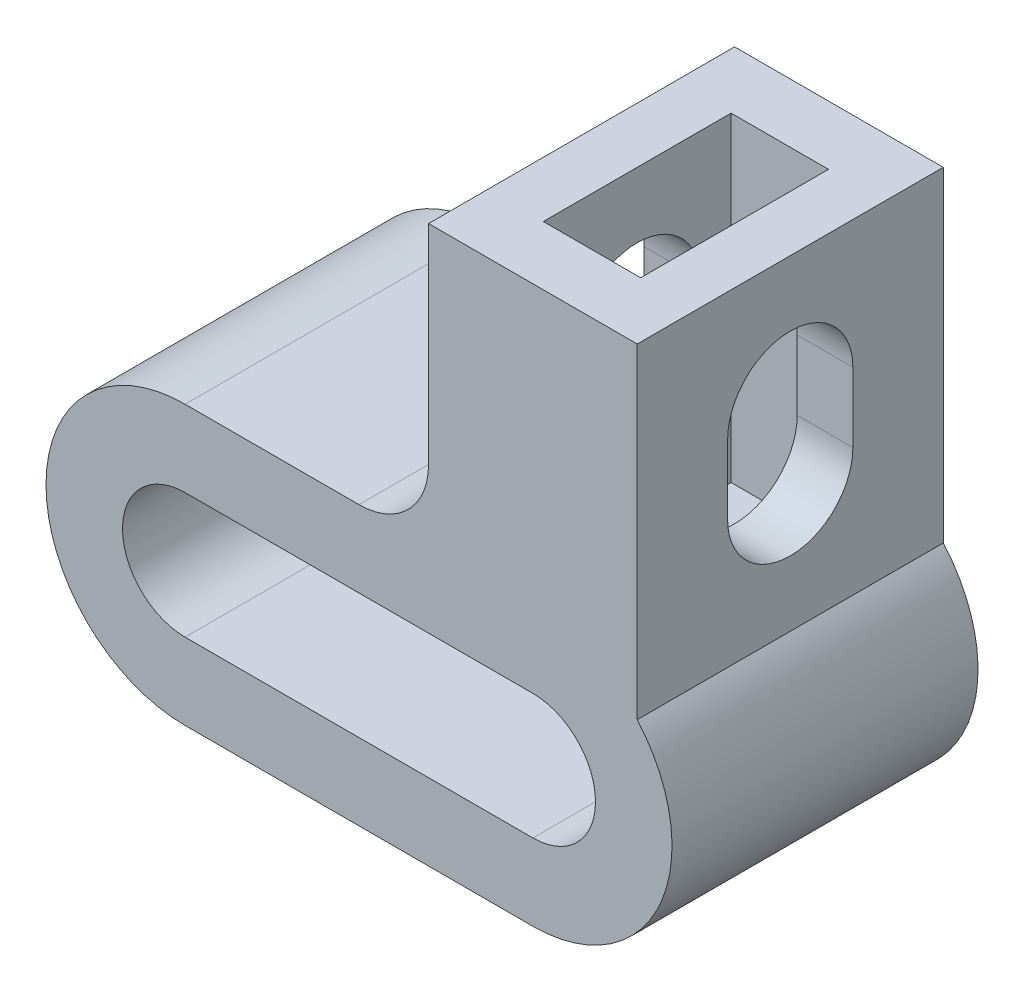
ISO-10303-21;
HEADER;
FILE_DESCRIPTION(('STEP AP214'),'2;1');
FILE_NAME('part.step','',(''),(''),'','','');
FILE_SCHEMA(('AUTOMOTIVE_DESIGN { 1 0 10303 214 1 1 1 1 }'));
ENDSEC;
DATA;
#1=APPLICATION_CONTEXT('core data for automotive mechanical design processes');
#2=APPLICATION_PROTOCOL_DEFINITION('international standard','automotive_design',2000,#1);
#3=PRODUCT_CONTEXT('',#1,'mechanical');
#4=PRODUCT('Part','Part','',(#3));
#5=PRODUCT_RELATED_PRODUCT_CATEGORY('part','',(#4));
#6=PRODUCT_DEFINITION_FORMATION('','',#4);
#7=PRODUCT_DEFINITION_CONTEXT('part definition',#1,'design');
#8=PRODUCT_DEFINITION('design','',#6,#7);
#9=PRODUCT_DEFINITION_SHAPE('','',#8);
#10=(LENGTH_UNIT() NAMED_UNIT(*) SI_UNIT(.MILLI.,.METRE.));
#11=(NAMED_UNIT(*) PLANE_ANGLE_UNIT() SI_UNIT($,.RADIAN.));
#12=(NAMED_UNIT(*) SI_UNIT($,.STERADIAN.) SOLID_ANGLE_UNIT());
#13=UNCERTAINTY_MEASURE_WITH_UNIT(LENGTH_MEASURE(1.E-05),#10,'distance_accuracy_value','');
#14=(GEOMETRIC_REPRESENTATION_CONTEXT(3) GLOBAL_UNCERTAINTY_ASSIGNED_CONTEXT((#13)) GLOBAL_UNIT_ASSIGNED_CONTEXT((#10,
#11,#12)) REPRESENTATION_CONTEXT('',''));
#15=CARTESIAN_POINT('',(0.,0.,0.));
#16=DIRECTION('',(0.,0.,1.));
#17=DIRECTION('',(1.,0.,0.));
#18=AXIS2_PLACEMENT_3D('',#15,#16,#17);
#19=CARTESIAN_POINT('',(7.5,0.,22.));
#20=DIRECTION('',(-1.,0.,0.));
#21=DIRECTION('',(0.,0.,1.));
#22=AXIS2_PLACEMENT_3D('',#19,#20,#21);
#23=PLANE('',#22);
#24=DIRECTION('',(0.,1.,0.));
#25=VECTOR('',#24,1.);
#26=CARTESIAN_POINT('',(7.5,0.,0.));
#27=LINE('',#26,#25);
#28=CARTESIAN_POINT('',(7.5,6.61437827766148,0.));
#29=VERTEX_POINT('',#28);
#30=CARTESIAN_POINT('',(7.5,30.,0.));
#31=VERTEX_POINT('',#30);
#32=EDGE_CURVE('E365',#29,#31,#27,.T.);
#33=ORIENTED_EDGE('',*,*,#32,.T.);
#34=DIRECTION('',(0.,0.,-1.));
#35=VECTOR('',#34,1.);
#36=CARTESIAN_POINT('',(7.5,30.,22.));
#37=LINE('',#36,#35);
#38=CARTESIAN_POINT('',(7.5,30.,22.));
#39=VERTEX_POINT('',#38);
#40=EDGE_CURVE('E395',#39,#31,#37,.T.);
#41=ORIENTED_EDGE('',*,*,#40,.F.);
#42=DIRECTION('',(0.,1.,0.));
#43=VECTOR('',#42,1.);
#44=CARTESIAN_POINT('',(7.5,0.,22.));
#45=LINE('',#44,#43);
#46=CARTESIAN_POINT('',(7.5,6.61437827766148,22.));
#47=VERTEX_POINT('',#46);
#48=EDGE_CURVE('E491',#47,#39,#45,.T.);
#49=ORIENTED_EDGE('',*,*,#48,.F.);
#50=DIRECTION('',(0.,0.,-1.));
#51=VECTOR('',#50,1.);
#52=CARTESIAN_POINT('',(7.5,6.61437827766148,22.));
#53=LINE('',#52,#51);
#54=EDGE_CURVE('E397',#47,#29,#53,.T.);
#55=ORIENTED_EDGE('',*,*,#54,.T.);
#56=EDGE_LOOP('',(#33,#41,#49,#55));
#57=FACE_BOUND('',#56,.T.);
#58=CARTESIAN_POINT('',(7.5,15.8071891388307,11.));
#59=DIRECTION('',(-1.,0.,0.));
#60=DIRECTION('',(0.,0.,1.));
#61=AXIS2_PLACEMENT_3D('',#58,#59,#60);
#62=CIRCLE('',#61,4.5);
#63=CARTESIAN_POINT('',(7.5,15.8071891388307,15.5));
#64=VERTEX_POINT('',#63);
#65=CARTESIAN_POINT('',(7.5,15.8071891388307,6.5));
#66=VERTEX_POINT('',#65);
#67=EDGE_CURVE('E441',#64,#66,#62,.F.);
#68=ORIENTED_EDGE('',*,*,#67,.F.);
#69=DIRECTION('',(0.,-1.,0.));
#70=VECTOR('',#69,1.);
#71=CARTESIAN_POINT('',(7.5,0.,15.5));
#72=LINE('',#71,#70);
#73=CARTESIAN_POINT('',(7.5,20.8071891388307,15.5));
#74=VERTEX_POINT('',#73);
#75=EDGE_CURVE('E226',#74,#64,#72,.T.);
#76=ORIENTED_EDGE('',*,*,#75,.F.);
#77=CARTESIAN_POINT('',(7.5,20.8071891388307,11.));
#78=DIRECTION('',(-1.,0.,0.));
#79=DIRECTION('',(0.,0.,1.));
#80=AXIS2_PLACEMENT_3D('',#77,#78,#79);
#81=CIRCLE('',#80,4.5);
#82=CARTESIAN_POINT('',(7.5,20.8071891388307,6.5));
#83=VERTEX_POINT('',#82);
#84=EDGE_CURVE('E217',#83,#74,#81,.F.);
#85=ORIENTED_EDGE('',*,*,#84,.F.);
#86=DIRECTION('',(0.,1.,0.));
#87=VECTOR('',#86,1.);
#88=CARTESIAN_POINT('',(7.5,0.,6.5));
#89=LINE('',#88,#87);
#90=EDGE_CURVE('E238',#66,#83,#89,.T.);
#91=ORIENTED_EDGE('',*,*,#90,.F.);
#92=EDGE_LOOP('',(#68,#76,#85,#91));
#93=FACE_BOUND('',#92,.T.);
#94=ADVANCED_FACE('F35',(#57,#93),#23,.F.);
#95=CARTESIAN_POINT('',(-7.5,0.,22.));
#96=DIRECTION('',(-1.,0.,0.));
#97=DIRECTION('',(0.,0.,1.));
#98=AXIS2_PLACEMENT_3D('',#95,#96,#97);
#99=PLANE('',#98);
#100=DIRECTION('',(0.,-1.,0.));
#101=VECTOR('',#100,1.);
#102=CARTESIAN_POINT('',(-7.5,0.,15.5));
#103=LINE('',#102,#101);
#104=CARTESIAN_POINT('',(-7.5,20.8071891388307,15.5));
#105=VERTEX_POINT('',#104);
#106=CARTESIAN_POINT('',(-7.5,15.8071891388307,15.5));
#107=VERTEX_POINT('',#106);
#108=EDGE_CURVE('E208',#105,#107,#103,.T.);
#109=ORIENTED_EDGE('',*,*,#108,.T.);
#110=CARTESIAN_POINT('',(-7.5,15.8071891388307,11.));
#111=DIRECTION('',(-1.,0.,0.));
#112=DIRECTION('',(0.,0.,1.));
#113=AXIS2_PLACEMENT_3D('',#110,#111,#112);
#114=CIRCLE('',#113,4.5);
#115=CARTESIAN_POINT('',(-7.5,15.,15.4270131798035));
#116=VERTEX_POINT('',#115);
#117=EDGE_CURVE('E436',#107,#116,#114,.F.);
#118=ORIENTED_EDGE('',*,*,#117,.T.);
#119=DIRECTION('',(0.,0.,-1.));
#120=VECTOR('',#119,1.);
#121=CARTESIAN_POINT('',(-7.5,15.,22.));
#122=LINE('',#121,#120);
#123=CARTESIAN_POINT('',(-7.5,15.,22.));
#124=VERTEX_POINT('',#123);
#125=EDGE_CURVE('E390',#124,#116,#122,.T.);
#126=ORIENTED_EDGE('',*,*,#125,.F.);
#127=DIRECTION('',(0.,1.,0.));
#128=VECTOR('',#127,1.);
#129=CARTESIAN_POINT('',(-7.5,0.,22.));
#130=LINE('',#129,#128);
#131=CARTESIAN_POINT('',(-7.5,30.,22.));
#132=VERTEX_POINT('',#131);
#133=EDGE_CURVE('E496',#124,#132,#130,.T.);
#134=ORIENTED_EDGE('',*,*,#133,.T.);
#135=DIRECTION('',(0.,0.,-1.));
#136=VECTOR('',#135,1.);
#137=CARTESIAN_POINT('',(-7.5,30.,22.));
#138=LINE('',#137,#136);
#139=CARTESIAN_POINT('',(-7.5,30.,0.));
#140=VERTEX_POINT('',#139);
#141=EDGE_CURVE('E393',#132,#140,#138,.T.);
#142=ORIENTED_EDGE('',*,*,#141,.T.);
#143=DIRECTION('',(0.,1.,0.));
#144=VECTOR('',#143,1.);
#145=CARTESIAN_POINT('',(-7.5,0.,0.));
#146=LINE('',#145,#144);
#147=CARTESIAN_POINT('',(-7.5,15.,0.));
#148=VERTEX_POINT('',#147);
#149=EDGE_CURVE('E370',#148,#140,#146,.T.);
#150=ORIENTED_EDGE('',*,*,#149,.F.);
#151=CARTESIAN_POINT('',(-7.5,15.,6.57298682019652));
#152=VERTEX_POINT('',#151);
#153=EDGE_CURVE('E389',#152,#148,#122,.T.);
#154=ORIENTED_EDGE('',*,*,#153,.F.);
#155=CARTESIAN_POINT('',(-7.5,15.8071891388307,6.5));
#156=VERTEX_POINT('',#155);
#157=EDGE_CURVE('E58',#152,#156,#114,.F.);
#158=ORIENTED_EDGE('',*,*,#157,.T.);
#159=DIRECTION('',(0.,1.,0.));
#160=VECTOR('',#159,1.);
#161=CARTESIAN_POINT('',(-7.5,0.,6.5));
#162=LINE('',#161,#160);
#163=CARTESIAN_POINT('',(-7.5,20.8071891388307,6.5));
#164=VERTEX_POINT('',#163);
#165=EDGE_CURVE('E235',#156,#164,#162,.T.);
#166=ORIENTED_EDGE('',*,*,#165,.T.);
#167=CARTESIAN_POINT('',(-7.5,20.8071891388307,11.));
#168=DIRECTION('',(-1.,0.,0.));
#169=DIRECTION('',(0.,0.,1.));
#170=AXIS2_PLACEMENT_3D('',#167,#168,#169);
#171=CIRCLE('',#170,4.5);
#172=EDGE_CURVE('E225',#164,#105,#171,.F.);
#173=ORIENTED_EDGE('',*,*,#172,.T.);
#174=EDGE_LOOP('',(#109,#118,#126,#134,#142,#150,#154,#158,#166,#173));
#175=FACE_BOUND('',#174,.T.);
#176=ADVANCED_FACE('F311',(#175),#99,.T.);
#177=CARTESIAN_POINT('',(-12.5,15.,22.));
#178=DIRECTION('',(0.,0.,-1.));
#179=DIRECTION('',(-1.,0.,0.));
#180=AXIS2_PLACEMENT_3D('',#177,#178,#179);
#181=CYLINDRICAL_SURFACE('',#180,5.);
#182=ORIENTED_EDGE('',*,*,#125,.T.);
#183=CARTESIAN_POINT('',(-7.5,15.,15.4270131798035));
#184=CARTESIAN_POINT('',(-7.49997471508249,14.8913077840519,15.4072214641731));
#185=CARTESIAN_POINT('',(-7.50354304966086,14.7833935964909,15.3833842019889));
#186=CARTESIAN_POINT('',(-7.51737646658634,14.5701136639406,15.3280142157194));
#187=CARTESIAN_POINT('',(-7.52763438140666,14.4647453163873,15.2964897506679));
#188=CARTESIAN_POINT('',(-7.55424639194066,14.2581832404196,15.2263923372156));
#189=CARTESIAN_POINT('',(-7.57054862473275,14.1569619063967,15.1878807372746));
#190=CARTESIAN_POINT('',(-7.60864424465544,13.9584300945017,15.1041090746346));
#191=CARTESIAN_POINT('',(-7.6304388967668,13.8611205235578,15.0588474582943));
#192=CARTESIAN_POINT('',(-7.70288566704483,13.5767010885505,14.9140739388203));
#193=CARTESIAN_POINT('',(-7.76074504039169,13.3960670650988,14.8052168879543));
#194=CARTESIAN_POINT('',(-7.89028242345123,13.0547480759243,14.5661884404784));
#195=CARTESIAN_POINT('',(-7.96199110713091,12.8941087185711,14.4359698297513));
#196=CARTESIAN_POINT('',(-8.12337189500613,12.5749204768652,14.1393910350993));
#197=CARTESIAN_POINT('',(-8.2141685252315,12.4192615809314,13.9705388555918));
#198=CARTESIAN_POINT('',(-8.39823990377053,12.1357124653929,13.6120064408322));
#199=CARTESIAN_POINT('',(-8.4915163064611,12.0078413340704,13.4223120222288));
#200=CARTESIAN_POINT('',(-8.66637754201002,11.7872062144436,13.0339437798514));
#201=CARTESIAN_POINT('',(-8.7483211222995,11.6929271088792,12.8362972549902));
#202=CARTESIAN_POINT('',(-8.89579841964129,11.5327815972576,12.424105123367));
#203=CARTESIAN_POINT('',(-8.96136648657203,11.4668555033832,12.2095961528466));
#204=CARTESIAN_POINT('',(-9.05186244410561,11.3787560513416,11.8180997615287));
#205=CARTESIAN_POINT('',(-9.08269913595322,11.3499683171109,11.6440107496782));
#206=CARTESIAN_POINT('',(-9.12244562517694,11.3131425539663,11.2913031829068));
#207=CARTESIAN_POINT('',(-9.13139169489751,11.3050701989797,11.1126926170762));
#208=CARTESIAN_POINT('',(-9.12570560831094,11.3102657465503,10.7560170761483));
#209=CARTESIAN_POINT('',(-9.11105201143748,11.3235530545848,10.5779527445963));
#210=CARTESIAN_POINT('',(-9.060875852984,11.3704609945878,10.2274333070717));
#211=CARTESIAN_POINT('',(-9.02531385452653,11.4041200547585,10.0549894527496));
#212=CARTESIAN_POINT('',(-8.92270633405167,11.5057440101789,9.65687990149469));
#213=CARTESIAN_POINT('',(-8.84888704222559,11.5817820119884,9.43503442411864));
#214=CARTESIAN_POINT('',(-8.7269344885363,11.7185747577488,9.11674536955891));
#215=CARTESIAN_POINT('',(-8.68434485680684,11.7680477201151,9.01292575413945));
#216=CARTESIAN_POINT('',(-8.59682083750125,11.8743114466265,8.81012424614602));
#217=CARTESIAN_POINT('',(-8.55188669837691,11.9311014363061,8.71114184310792));
#218=CARTESIAN_POINT('',(-8.41241903493007,12.116246444494,8.41495741543997));
#219=CARTESIAN_POINT('',(-8.31615009644209,12.2562742909458,8.22571892721576));
#220=CARTESIAN_POINT('',(-8.12897109631137,12.5654973897316,7.87000332471217));
#221=CARTESIAN_POINT('',(-8.03805713829006,12.7346710742647,7.703509541637));
#222=CARTESIAN_POINT('',(-7.87781425197085,13.0845459532866,7.41051977521911));
#223=CARTESIAN_POINT('',(-7.80727131597867,13.2627748832869,7.28175766680785));
#224=CARTESIAN_POINT('',(-7.68430207509904,13.6404809820267,7.04977921546457));
#225=CARTESIAN_POINT('',(-7.63182918219285,13.83990174843,6.94649737772414));
#226=CARTESIAN_POINT('',(-7.56219556154501,14.1989170860046,6.79400950838239));
#227=CARTESIAN_POINT('',(-7.53929364779376,14.3543977533261,6.73774273405555));
#228=CARTESIAN_POINT('',(-7.51595971400224,14.5928487512128,6.66614265460484));
#229=CARTESIAN_POINT('',(-7.51001732883676,14.6734002204145,6.64437321665019));
#230=CARTESIAN_POINT('',(-7.50203330652672,14.835817234281,6.60529547966579));
#231=CARTESIAN_POINT('',(-7.49999396600165,14.9176835240607,6.58798981237458));
#232=CARTESIAN_POINT('',(-7.5,15.,6.57298682019652));
#233=B_SPLINE_CURVE_WITH_KNOTS('',3,(#183,#184,#185,#186,#187,#188,#189,#190,#191,#192,#193,
#194,#195,#196,#197,#198,#199,#200,#201,#202,#203,#204,#205,#206,#207,#208,#209,#210,#211,#212,
#213,#214,#215,#216,#217,#218,#219,#220,#221,#222,#223,#224,#225,#226,#227,#228,#229,#230,#231,
#232),.UNSPECIFIED.,.F.,.F.,(4,2,2,2,2,2,2,2,2,2,2,2,2,2,2,2,2,2,2,2,2,2,2,2,4),(0.,
0.331243704142386,0.662133080224524,0.990246617094524,1.31843579226186,1.9715482661598,
2.62612421952053,3.36434176654526,4.10306482637942,4.8021666745491,5.49978950581455,
6.03491703787051,6.56915727153477,7.10388314240726,7.63962084953676,8.37289337309912,
8.74057053696276,9.10820881622056,9.86835609794051,10.6279432710851,11.3180079647477,
12.0062799812122,12.5054259437164,12.7561841511695,13.0070898638137),.UNSPECIFIED.);
#234=EDGE_CURVE('E242',#116,#152,#233,.T.);
#235=ORIENTED_EDGE('',*,*,#234,.T.);
#236=ORIENTED_EDGE('',*,*,#153,.T.);
#237=CARTESIAN_POINT('',(-12.5,15.,0.));
#238=DIRECTION('',(0.,0.,1.));
#239=DIRECTION('',(1.,0.,0.));
#240=AXIS2_PLACEMENT_3D('',#237,#238,#239);
#241=CIRCLE('',#240,5.);
#242=CARTESIAN_POINT('',(-12.5,9.99999999999999,0.));
#243=VERTEX_POINT('',#242);
#244=EDGE_CURVE('E373',#243,#148,#241,.T.);
#245=ORIENTED_EDGE('',*,*,#244,.F.);
#246=DIRECTION('',(0.,0.,-1.));
#247=VECTOR('',#246,1.);
#248=CARTESIAN_POINT('',(-12.5,9.99999999999999,22.));
#249=LINE('',#248,#247);
#250=CARTESIAN_POINT('',(-12.5,9.99999999999999,22.));
#251=VERTEX_POINT('',#250);
#252=EDGE_CURVE('E387',#251,#243,#249,.T.);
#253=ORIENTED_EDGE('',*,*,#252,.F.);
#254=CARTESIAN_POINT('',(-12.5,15.,22.));
#255=DIRECTION('',(0.,0.,1.));
#256=DIRECTION('',(1.,0.,0.));
#257=AXIS2_PLACEMENT_3D('',#254,#255,#256);
#258=CIRCLE('',#257,5.);
#259=EDGE_CURVE('E499',#251,#124,#258,.T.);
#260=ORIENTED_EDGE('',*,*,#259,.T.);
#261=EDGE_LOOP('',(#182,#235,#236,#245,#253,#260));
#262=FACE_BOUND('',#261,.T.);
#263=ADVANCED_FACE('F250',(#262),#181,.F.);
#264=CARTESIAN_POINT('',(3.5,7.,4.25));
#265=DIRECTION('',(1.,0.,0.));
#266=DIRECTION('',(0.,0.,-1.));
#267=AXIS2_PLACEMENT_3D('',#264,#265,#266);
#268=PLANE('',#267);
#269=DIRECTION('',(0.,0.,-1.));
#270=VECTOR('',#269,1.);
#271=CARTESIAN_POINT('',(3.5,30.,4.25));
#272=LINE('',#271,#270);
#273=CARTESIAN_POINT('',(3.5,30.,17.75));
#274=VERTEX_POINT('',#273);
#275=CARTESIAN_POINT('',(3.5,30.,4.25));
#276=VERTEX_POINT('',#275);
#277=EDGE_CURVE('E442',#274,#276,#272,.T.);
#278=ORIENTED_EDGE('',*,*,#277,.T.);
#279=DIRECTION('',(0.,1.,0.));
#280=VECTOR('',#279,1.);
#281=CARTESIAN_POINT('',(3.5,7.,4.25));
#282=LINE('',#281,#280);
#283=CARTESIAN_POINT('',(3.5,7.,4.25));
#284=VERTEX_POINT('',#283);
#285=EDGE_CURVE('E461',#284,#276,#282,.T.);
#286=ORIENTED_EDGE('',*,*,#285,.F.);
#287=DIRECTION('',(0.,0.,-1.));
#288=VECTOR('',#287,1.);
#289=CARTESIAN_POINT('',(3.5,7.,4.25));
#290=LINE('',#289,#288);
#291=CARTESIAN_POINT('',(3.5,7.,17.75));
#292=VERTEX_POINT('',#291);
#293=EDGE_CURVE('E449',#292,#284,#290,.T.);
#294=ORIENTED_EDGE('',*,*,#293,.F.);
#295=DIRECTION('',(0.,1.,0.));
#296=VECTOR('',#295,1.);
#297=CARTESIAN_POINT('',(3.5,7.,17.75));
#298=LINE('',#297,#296);
#299=EDGE_CURVE('E470',#292,#274,#298,.T.);
#300=ORIENTED_EDGE('',*,*,#299,.T.);
#301=EDGE_LOOP('',(#278,#286,#294,#300));
#302=FACE_BOUND('',#301,.T.);
#303=CARTESIAN_POINT('',(3.5,15.8071891388307,11.));
#304=DIRECTION('',(1.,0.,0.));
#305=DIRECTION('',(0.,0.,-1.));
#306=AXIS2_PLACEMENT_3D('',#303,#304,#305);
#307=CIRCLE('',#306,4.5);
#308=CARTESIAN_POINT('',(3.5,15.8071891388307,6.5));
#309=VERTEX_POINT('',#308);
#310=CARTESIAN_POINT('',(3.5,15.8071891388307,15.5));
#311=VERTEX_POINT('',#310);
#312=EDGE_CURVE('E240',#309,#311,#307,.F.);
#313=ORIENTED_EDGE('',*,*,#312,.F.);
#314=DIRECTION('',(0.,-1.,0.));
#315=VECTOR('',#314,1.);
#316=CARTESIAN_POINT('',(3.5,7.,6.5));
#317=LINE('',#316,#315);
#318=CARTESIAN_POINT('',(3.5,20.8071891388307,6.5));
#319=VERTEX_POINT('',#318);
#320=EDGE_CURVE('E224',#319,#309,#317,.T.);
#321=ORIENTED_EDGE('',*,*,#320,.F.);
#322=CARTESIAN_POINT('',(3.5,20.8071891388307,11.));
#323=DIRECTION('',(1.,0.,0.));
#324=DIRECTION('',(0.,0.,-1.));
#325=AXIS2_PLACEMENT_3D('',#322,#323,#324);
#326=CIRCLE('',#325,4.5);
#327=CARTESIAN_POINT('',(3.5,20.8071891388307,15.5));
#328=VERTEX_POINT('',#327);
#329=EDGE_CURVE('E214',#328,#319,#326,.F.);
#330=ORIENTED_EDGE('',*,*,#329,.F.);
#331=DIRECTION('',(0.,1.,0.));
#332=VECTOR('',#331,1.);
#333=CARTESIAN_POINT('',(3.5,7.,15.5));
#334=LINE('',#333,#332);
#335=EDGE_CURVE('E200',#311,#328,#334,.T.);
#336=ORIENTED_EDGE('',*,*,#335,.F.);
#337=EDGE_LOOP('',(#313,#321,#330,#336));
#338=FACE_BOUND('',#337,.T.);
#339=ADVANCED_FACE('F223',(#302,#338),#268,.F.);
#340=CARTESIAN_POINT('',(-3.5,7.,4.25));
#341=DIRECTION('',(-1.,0.,0.));
#342=DIRECTION('',(0.,0.,1.));
#343=AXIS2_PLACEMENT_3D('',#340,#341,#342);
#344=PLANE('',#343);
#345=DIRECTION('',(0.,0.,1.));
#346=VECTOR('',#345,1.);
#347=CARTESIAN_POINT('',(-3.5,30.,4.25));
#348=LINE('',#347,#346);
#349=CARTESIAN_POINT('',(-3.5,30.,4.25));
#350=VERTEX_POINT('',#349);
#351=CARTESIAN_POINT('',(-3.5,30.,17.75));
#352=VERTEX_POINT('',#351);
#353=EDGE_CURVE('E465',#350,#352,#348,.T.);
#354=ORIENTED_EDGE('',*,*,#353,.T.);
#355=DIRECTION('',(0.,1.,0.));
#356=VECTOR('',#355,1.);
#357=CARTESIAN_POINT('',(-3.5,7.,17.75));
#358=LINE('',#357,#356);
#359=CARTESIAN_POINT('',(-3.5,7.,17.75));
#360=VERTEX_POINT('',#359);
#361=EDGE_CURVE('E472',#360,#352,#358,.T.);
#362=ORIENTED_EDGE('',*,*,#361,.F.);
#363=DIRECTION('',(0.,0.,1.));
#364=VECTOR('',#363,1.);
#365=CARTESIAN_POINT('',(-3.5,7.,4.25));
#366=LINE('',#365,#364);
#367=CARTESIAN_POINT('',(-3.5,7.,4.25));
#368=VERTEX_POINT('',#367);
#369=EDGE_CURVE('E456',#368,#360,#366,.T.);
#370=ORIENTED_EDGE('',*,*,#369,.F.);
#371=DIRECTION('',(0.,1.,0.));
#372=VECTOR('',#371,1.);
#373=CARTESIAN_POINT('',(-3.5,7.,4.25));
#374=LINE('',#373,#372);
#375=EDGE_CURVE('E474',#368,#350,#374,.T.);
#376=ORIENTED_EDGE('',*,*,#375,.T.);
#377=EDGE_LOOP('',(#354,#362,#370,#376));
#378=FACE_BOUND('',#377,.T.);
#379=CARTESIAN_POINT('',(-3.5,15.8071891388307,11.));
#380=DIRECTION('',(-1.,0.,0.));
#381=DIRECTION('',(0.,0.,1.));
#382=AXIS2_PLACEMENT_3D('',#379,#380,#381);
#383=CIRCLE('',#382,4.5);
#384=CARTESIAN_POINT('',(-3.5,15.8071891388307,15.5));
#385=VERTEX_POINT('',#384);
#386=CARTESIAN_POINT('',(-3.5,15.8071891388307,6.5));
#387=VERTEX_POINT('',#386);
#388=EDGE_CURVE('E11',#385,#387,#383,.F.);
#389=ORIENTED_EDGE('',*,*,#388,.F.);
#390=DIRECTION('',(0.,-1.,0.));
#391=VECTOR('',#390,1.);
#392=CARTESIAN_POINT('',(-3.5,7.,15.5));
#393=LINE('',#392,#391);
#394=CARTESIAN_POINT('',(-3.5,20.8071891388307,15.5));
#395=VERTEX_POINT('',#394);
#396=EDGE_CURVE('E403',#395,#385,#393,.T.);
#397=ORIENTED_EDGE('',*,*,#396,.F.);
#398=CARTESIAN_POINT('',(-3.5,20.8071891388307,11.));
#399=DIRECTION('',(-1.,0.,0.));
#400=DIRECTION('',(0.,0.,1.));
#401=AXIS2_PLACEMENT_3D('',#398,#399,#400);
#402=CIRCLE('',#401,4.5);
#403=CARTESIAN_POINT('',(-3.5,20.8071891388307,6.5));
#404=VERTEX_POINT('',#403);
#405=EDGE_CURVE('E412',#404,#395,#402,.F.);
#406=ORIENTED_EDGE('',*,*,#405,.F.);
#407=DIRECTION('',(0.,1.,0.));
#408=VECTOR('',#407,1.);
#409=CARTESIAN_POINT('',(-3.5,7.,6.5));
#410=LINE('',#409,#408);
#411=EDGE_CURVE('E43',#387,#404,#410,.T.);
#412=ORIENTED_EDGE('',*,*,#411,.F.);
#413=EDGE_LOOP('',(#389,#397,#406,#412));
#414=FACE_BOUND('',#413,.T.);
#415=ADVANCED_FACE('F274',(#378,#414),#344,.F.);
#416=CARTESIAN_POINT('',(0.,-10.,22.));
#417=DIRECTION('',(0.,1.,0.));
#418=DIRECTION('',(-1.,0.,0.));
#419=AXIS2_PLACEMENT_3D('',#416,#417,#418);
#420=PLANE('',#419);
#421=DIRECTION('',(1.,0.,0.));
#422=VECTOR('',#421,1.);
#423=CARTESIAN_POINT('',(0.,-10.,0.));
#424=LINE('',#423,#422);
#425=CARTESIAN_POINT('',(-25.,-10.,0.));
#426=VERTEX_POINT('',#425);
#427=CARTESIAN_POINT('',(0.,-10.,0.));
#428=VERTEX_POINT('',#427);
#429=EDGE_CURVE('E357',#426,#428,#424,.T.);
#430=ORIENTED_EDGE('',*,*,#429,.T.);
#431=DIRECTION('',(0.,0.,-1.));
#432=VECTOR('',#431,1.);
#433=CARTESIAN_POINT('',(0.,-10.,22.));
#434=LINE('',#433,#432);
#435=CARTESIAN_POINT('',(0.,-10.,22.));
#436=VERTEX_POINT('',#435);
#437=EDGE_CURVE('E400',#436,#428,#434,.T.);
#438=ORIENTED_EDGE('',*,*,#437,.F.);
#439=DIRECTION('',(1.,0.,0.));
#440=VECTOR('',#439,1.);
#441=CARTESIAN_POINT('',(0.,-10.,22.));
#442=LINE('',#441,#440);
#443=CARTESIAN_POINT('',(-25.,-10.,22.));
#444=VERTEX_POINT('',#443);
#445=EDGE_CURVE('E486',#444,#436,#442,.T.);
#446=ORIENTED_EDGE('',*,*,#445,.F.);
#447=DIRECTION('',(0.,0.,-1.));
#448=VECTOR('',#447,1.);
#449=CARTESIAN_POINT('',(-25.,-10.,22.));
#450=LINE('',#449,#448);
#451=EDGE_CURVE('E382',#444,#426,#450,.T.);
#452=ORIENTED_EDGE('',*,*,#451,.T.);
#453=EDGE_LOOP('',(#430,#438,#446,#452));
#454=FACE_BOUND('',#453,.T.);
#455=ADVANCED_FACE('F277',(#454),#420,.F.);
#456=CARTESIAN_POINT('',(0.,0.,22.));
#457=DIRECTION('',(0.,0.,-1.));
#458=DIRECTION('',(-1.,0.,0.));
#459=AXIS2_PLACEMENT_3D('',#456,#457,#458);
#460=CYLINDRICAL_SURFACE('',#459,10.);
#461=CARTESIAN_POINT('',(0.,0.,0.));
#462=DIRECTION('',(0.,0.,1.));
#463=DIRECTION('',(1.,0.,0.));
#464=AXIS2_PLACEMENT_3D('',#461,#462,#463);
#465=CIRCLE('',#464,10.);
#466=EDGE_CURVE('E363',#428,#29,#465,.T.);
#467=ORIENTED_EDGE('',*,*,#466,.T.);
#468=ORIENTED_EDGE('',*,*,#54,.F.);
#469=CARTESIAN_POINT('',(0.,0.,22.));
#470=DIRECTION('',(0.,0.,1.));
#471=DIRECTION('',(1.,0.,0.));
#472=AXIS2_PLACEMENT_3D('',#469,#470,#471);
#473=CIRCLE('',#472,10.);
#474=EDGE_CURVE('E489',#436,#47,#473,.T.);
#475=ORIENTED_EDGE('',*,*,#474,.F.);
#476=ORIENTED_EDGE('',*,*,#437,.T.);
#477=EDGE_LOOP('',(#467,#468,#475,#476));
#478=FACE_BOUND('',#477,.T.);
#479=ADVANCED_FACE('F306',(#478),#460,.T.);
#480=CARTESIAN_POINT('',(0.,30.,22.));
#481=DIRECTION('',(0.,1.,0.));
#482=DIRECTION('',(0.,0.,1.));
#483=AXIS2_PLACEMENT_3D('',#480,#481,#482);
#484=PLANE('',#483);
#485=ORIENTED_EDGE('',*,*,#277,.F.);
#486=DIRECTION('',(1.,0.,0.));
#487=VECTOR('',#486,1.);
#488=CARTESIAN_POINT('',(-3.5,30.,17.75));
#489=LINE('',#488,#487);
#490=EDGE_CURVE('E453',#352,#274,#489,.T.);
#491=ORIENTED_EDGE('',*,*,#490,.F.);
#492=ORIENTED_EDGE('',*,*,#353,.F.);
#493=DIRECTION('',(-1.,0.,0.));
#494=VECTOR('',#493,1.);
#495=CARTESIAN_POINT('',(-3.5,30.,4.25));
#496=LINE('',#495,#494);
#497=EDGE_CURVE('E446',#276,#350,#496,.T.);
#498=ORIENTED_EDGE('',*,*,#497,.F.);
#499=EDGE_LOOP('',(#485,#491,#492,#498));
#500=FACE_BOUND('',#499,.T.);
#501=DIRECTION('',(1.,0.,0.));
#502=VECTOR('',#501,1.);
#503=CARTESIAN_POINT('',(0.,30.,0.));
#504=LINE('',#503,#502);
#505=EDGE_CURVE('E367',#140,#31,#504,.T.);
#506=ORIENTED_EDGE('',*,*,#505,.F.);
#507=ORIENTED_EDGE('',*,*,#141,.F.);
#508=DIRECTION('',(1.,0.,0.));
#509=VECTOR('',#508,1.);
#510=CARTESIAN_POINT('',(0.,30.,22.));
#511=LINE('',#510,#509);
#512=EDGE_CURVE('E493',#132,#39,#511,.T.);
#513=ORIENTED_EDGE('',*,*,#512,.T.);
#514=ORIENTED_EDGE('',*,*,#40,.T.);
#515=EDGE_LOOP('',(#506,#507,#513,#514));
#516=FACE_BOUND('',#515,.T.);
#517=ADVANCED_FACE('F298',(#500,#516),#484,.T.);
#518=CARTESIAN_POINT('',(0.,9.99999999999999,22.));
#519=DIRECTION('',(0.,1.,0.));
#520=DIRECTION('',(-1.,0.,0.));
#521=AXIS2_PLACEMENT_3D('',#518,#519,#520);
#522=PLANE('',#521);
#523=DIRECTION('',(1.,0.,0.));
#524=VECTOR('',#523,1.);
#525=CARTESIAN_POINT('',(0.,9.99999999999999,0.));
#526=LINE('',#525,#524);
#527=CARTESIAN_POINT('',(-25.,10.,0.));
#528=VERTEX_POINT('',#527);
#529=EDGE_CURVE('E376',#528,#243,#526,.T.);
#530=ORIENTED_EDGE('',*,*,#529,.F.);
#531=DIRECTION('',(0.,0.,-1.));
#532=VECTOR('',#531,1.);
#533=CARTESIAN_POINT('',(-25.,10.,22.));
#534=LINE('',#533,#532);
#535=CARTESIAN_POINT('',(-25.,10.,22.));
#536=VERTEX_POINT('',#535);
#537=EDGE_CURVE('E385',#536,#528,#534,.T.);
#538=ORIENTED_EDGE('',*,*,#537,.F.);
#539=DIRECTION('',(1.,0.,0.));
#540=VECTOR('',#539,1.);
#541=CARTESIAN_POINT('',(0.,9.99999999999999,22.));
#542=LINE('',#541,#540);
#543=EDGE_CURVE('E502',#536,#251,#542,.T.);
#544=ORIENTED_EDGE('',*,*,#543,.T.);
#545=ORIENTED_EDGE('',*,*,#252,.T.);
#546=EDGE_LOOP('',(#530,#538,#544,#545));
#547=FACE_BOUND('',#546,.T.);
#548=ADVANCED_FACE('F296',(#547),#522,.T.);
#549=CARTESIAN_POINT('',(-25.,0.,22.));
#550=DIRECTION('',(0.,0.,-1.));
#551=DIRECTION('',(-1.,0.,0.));
#552=AXIS2_PLACEMENT_3D('',#549,#550,#551);
#553=CYLINDRICAL_SURFACE('',#552,4.5);
#554=CARTESIAN_POINT('',(-25.,0.,0.));
#555=DIRECTION('',(0.,0.,1.));
#556=DIRECTION('',(1.,0.,0.));
#557=AXIS2_PLACEMENT_3D('',#554,#555,#556);
#558=CIRCLE('',#557,4.5);
#559=CARTESIAN_POINT('',(-25.,4.5,0.));
#560=VERTEX_POINT('',#559);
#561=CARTESIAN_POINT('',(-25.,-4.5,0.));
#562=VERTEX_POINT('',#561);
#563=EDGE_CURVE('E349',#560,#562,#558,.T.);
#564=ORIENTED_EDGE('',*,*,#563,.F.);
#565=DIRECTION('',(0.,0.,-1.));
#566=VECTOR('',#565,1.);
#567=CARTESIAN_POINT('',(-25.,4.5,22.));
#568=LINE('',#567,#566);
#569=CARTESIAN_POINT('',(-25.,4.5,22.));
#570=VERTEX_POINT('',#569);
#571=EDGE_CURVE('E345',#570,#560,#568,.T.);
#572=ORIENTED_EDGE('',*,*,#571,.F.);
#573=CARTESIAN_POINT('',(-25.,0.,22.));
#574=DIRECTION('',(0.,0.,1.));
#575=DIRECTION('',(1.,0.,0.));
#576=AXIS2_PLACEMENT_3D('',#573,#574,#575);
#577=CIRCLE('',#576,4.5);
#578=CARTESIAN_POINT('',(-25.,-4.5,22.));
#579=VERTEX_POINT('',#578);
#580=EDGE_CURVE('E381',#570,#579,#577,.T.);
#581=ORIENTED_EDGE('',*,*,#580,.T.);
#582=DIRECTION('',(0.,0.,-1.));
#583=VECTOR('',#582,1.);
#584=CARTESIAN_POINT('',(-25.,-4.5,22.));
#585=LINE('',#584,#583);
#586=EDGE_CURVE('E404',#579,#562,#585,.T.);
#587=ORIENTED_EDGE('',*,*,#586,.T.);
#588=EDGE_LOOP('',(#564,#572,#581,#587));
#589=FACE_BOUND('',#588,.T.);
#590=ADVANCED_FACE('F37',(#589),#553,.F.);
#591=CARTESIAN_POINT('',(0.,4.5,22.));
#592=DIRECTION('',(0.,1.,0.));
#593=DIRECTION('',(-1.,0.,0.));
#594=AXIS2_PLACEMENT_3D('',#591,#592,#593);
#595=PLANE('',#594);
#596=DIRECTION('',(1.,0.,0.));
#597=VECTOR('',#596,1.);
#598=CARTESIAN_POINT('',(0.,4.5,0.));
#599=LINE('',#598,#597);
#600=CARTESIAN_POINT('',(0.,4.5,0.));
#601=VERTEX_POINT('',#600);
#602=EDGE_CURVE('E340',#560,#601,#599,.T.);
#603=ORIENTED_EDGE('',*,*,#602,.T.);
#604=DIRECTION('',(0.,0.,-1.));
#605=VECTOR('',#604,1.);
#606=CARTESIAN_POINT('',(0.,4.5,22.));
#607=LINE('',#606,#605);
#608=CARTESIAN_POINT('',(0.,4.5,22.));
#609=VERTEX_POINT('',#608);
#610=EDGE_CURVE('E343',#609,#601,#607,.T.);
#611=ORIENTED_EDGE('',*,*,#610,.F.);
#612=DIRECTION('',(1.,0.,0.));
#613=VECTOR('',#612,1.);
#614=CARTESIAN_POINT('',(0.,4.5,22.));
#615=LINE('',#614,#613);
#616=EDGE_CURVE('E480',#570,#609,#615,.T.);
#617=ORIENTED_EDGE('',*,*,#616,.F.);
#618=ORIENTED_EDGE('',*,*,#571,.T.);
#619=EDGE_LOOP('',(#603,#611,#617,#618));
#620=FACE_BOUND('',#619,.T.);
#621=ADVANCED_FACE('F304',(#620),#595,.F.);
#622=CARTESIAN_POINT('',(0.,0.,22.));
#623=DIRECTION('',(0.,0.,-1.));
#624=DIRECTION('',(-1.,0.,0.));
#625=AXIS2_PLACEMENT_3D('',#622,#623,#624);
#626=CYLINDRICAL_SURFACE('',#625,4.5);
#627=CARTESIAN_POINT('',(0.,0.,0.));
#628=DIRECTION('',(0.,0.,1.));
#629=DIRECTION('',(1.,0.,0.));
#630=AXIS2_PLACEMENT_3D('',#627,#628,#629);
#631=CIRCLE('',#630,4.5);
#632=CARTESIAN_POINT('',(0.,-4.5,0.));
#633=VERTEX_POINT('',#632);
#634=EDGE_CURVE('E348',#633,#601,#631,.T.);
#635=ORIENTED_EDGE('',*,*,#634,.F.);
#636=DIRECTION('',(0.,0.,-1.));
#637=VECTOR('',#636,1.);
#638=CARTESIAN_POINT('',(0.,-4.5,22.));
#639=LINE('',#638,#637);
#640=CARTESIAN_POINT('',(0.,-4.5,22.));
#641=VERTEX_POINT('',#640);
#642=EDGE_CURVE('E406',#641,#633,#639,.T.);
#643=ORIENTED_EDGE('',*,*,#642,.F.);
#644=CARTESIAN_POINT('',(0.,0.,22.));
#645=DIRECTION('',(0.,0.,1.));
#646=DIRECTION('',(1.,0.,0.));
#647=AXIS2_PLACEMENT_3D('',#644,#645,#646);
#648=CIRCLE('',#647,4.5);
#649=EDGE_CURVE('E482',#641,#609,#648,.T.);
#650=ORIENTED_EDGE('',*,*,#649,.T.);
#651=ORIENTED_EDGE('',*,*,#610,.T.);
#652=EDGE_LOOP('',(#635,#643,#650,#651));
#653=FACE_BOUND('',#652,.T.);
#654=ADVANCED_FACE('F329',(#653),#626,.F.);
#655=CARTESIAN_POINT('',(0.,-4.5,22.));
#656=DIRECTION('',(0.,-1.,0.));
#657=DIRECTION('',(1.,0.,0.));
#658=AXIS2_PLACEMENT_3D('',#655,#656,#657);
#659=PLANE('',#658);
#660=DIRECTION('',(-1.,0.,0.));
#661=VECTOR('',#660,1.);
#662=CARTESIAN_POINT('',(0.,-4.5,0.));
#663=LINE('',#662,#661);
#664=EDGE_CURVE('E355',#633,#562,#663,.T.);
#665=ORIENTED_EDGE('',*,*,#664,.T.);
#666=ORIENTED_EDGE('',*,*,#586,.F.);
#667=DIRECTION('',(-1.,0.,0.));
#668=VECTOR('',#667,1.);
#669=CARTESIAN_POINT('',(0.,-4.5,22.));
#670=LINE('',#669,#668);
#671=EDGE_CURVE('E484',#641,#579,#670,.T.);
#672=ORIENTED_EDGE('',*,*,#671,.F.);
#673=ORIENTED_EDGE('',*,*,#642,.T.);
#674=EDGE_LOOP('',(#665,#666,#672,#673));
#675=FACE_BOUND('',#674,.T.);
#676=ADVANCED_FACE('F294',(#675),#659,.F.);
#677=CARTESIAN_POINT('',(-25.,0.,22.));
#678=DIRECTION('',(0.,0.,-1.));
#679=DIRECTION('',(-1.,0.,0.));
#680=AXIS2_PLACEMENT_3D('',#677,#678,#679);
#681=CYLINDRICAL_SURFACE('',#680,10.);
#682=CARTESIAN_POINT('',(-25.,0.,0.));
#683=DIRECTION('',(0.,0.,1.));
#684=DIRECTION('',(1.,0.,0.));
#685=AXIS2_PLACEMENT_3D('',#682,#683,#684);
#686=CIRCLE('',#685,10.);
#687=EDGE_CURVE('E379',#528,#426,#686,.T.);
#688=ORIENTED_EDGE('',*,*,#687,.T.);
#689=ORIENTED_EDGE('',*,*,#451,.F.);
#690=CARTESIAN_POINT('',(-25.,0.,22.));
#691=DIRECTION('',(0.,0.,1.));
#692=DIRECTION('',(1.,0.,0.));
#693=AXIS2_PLACEMENT_3D('',#690,#691,#692);
#694=CIRCLE('',#693,10.);
#695=EDGE_CURVE('E407',#536,#444,#694,.T.);
#696=ORIENTED_EDGE('',*,*,#695,.F.);
#697=ORIENTED_EDGE('',*,*,#537,.T.);
#698=EDGE_LOOP('',(#688,#689,#696,#697));
#699=FACE_BOUND('',#698,.T.);
#700=ADVANCED_FACE('F288',(#699),#681,.T.);
#701=CARTESIAN_POINT('',(0.,0.,22.));
#702=DIRECTION('',(0.,0.,1.));
#703=DIRECTION('',(1.,0.,0.));
#704=AXIS2_PLACEMENT_3D('',#701,#702,#703);
#705=PLANE('',#704);
#706=ORIENTED_EDGE('',*,*,#580,.F.);
#707=ORIENTED_EDGE('',*,*,#616,.T.);
#708=ORIENTED_EDGE('',*,*,#649,.F.);
#709=ORIENTED_EDGE('',*,*,#671,.T.);
#710=EDGE_LOOP('',(#706,#707,#708,#709));
#711=FACE_BOUND('',#710,.T.);
#712=ORIENTED_EDGE('',*,*,#445,.T.);
#713=ORIENTED_EDGE('',*,*,#474,.T.);
#714=ORIENTED_EDGE('',*,*,#48,.T.);
#715=ORIENTED_EDGE('',*,*,#512,.F.);
#716=ORIENTED_EDGE('',*,*,#133,.F.);
#717=ORIENTED_EDGE('',*,*,#259,.F.);
#718=ORIENTED_EDGE('',*,*,#543,.F.);
#719=ORIENTED_EDGE('',*,*,#695,.T.);
#720=EDGE_LOOP('',(#712,#713,#714,#715,#716,#717,#718,#719));
#721=FACE_BOUND('',#720,.T.);
#722=ADVANCED_FACE('F285',(#711,#721),#705,.T.);
#723=CARTESIAN_POINT('',(0.,0.,0.));
#724=DIRECTION('',(0.,0.,1.));
#725=DIRECTION('',(1.,0.,0.));
#726=AXIS2_PLACEMENT_3D('',#723,#724,#725);
#727=PLANE('',#726);
#728=ORIENTED_EDGE('',*,*,#563,.T.);
#729=ORIENTED_EDGE('',*,*,#664,.F.);
#730=ORIENTED_EDGE('',*,*,#634,.T.);
#731=ORIENTED_EDGE('',*,*,#602,.F.);
#732=EDGE_LOOP('',(#728,#729,#730,#731));
#733=FACE_BOUND('',#732,.T.);
#734=ORIENTED_EDGE('',*,*,#429,.F.);
#735=ORIENTED_EDGE('',*,*,#687,.F.);
#736=ORIENTED_EDGE('',*,*,#529,.T.);
#737=ORIENTED_EDGE('',*,*,#244,.T.);
#738=ORIENTED_EDGE('',*,*,#149,.T.);
#739=ORIENTED_EDGE('',*,*,#505,.T.);
#740=ORIENTED_EDGE('',*,*,#32,.F.);
#741=ORIENTED_EDGE('',*,*,#466,.F.);
#742=EDGE_LOOP('',(#734,#735,#736,#737,#738,#739,#740,#741));
#743=FACE_BOUND('',#742,.T.);
#744=ADVANCED_FACE('F272',(#733,#743),#727,.F.);
#745=CARTESIAN_POINT('',(-3.5,7.,17.75));
#746=DIRECTION('',(0.,0.,1.));
#747=DIRECTION('',(1.,0.,0.));
#748=AXIS2_PLACEMENT_3D('',#745,#746,#747);
#749=PLANE('',#748);
#750=ORIENTED_EDGE('',*,*,#490,.T.);
#751=ORIENTED_EDGE('',*,*,#299,.F.);
#752=DIRECTION('',(1.,0.,0.));
#753=VECTOR('',#752,1.);
#754=CARTESIAN_POINT('',(-3.5,7.,17.75));
#755=LINE('',#754,#753);
#756=EDGE_CURVE('E459',#360,#292,#755,.T.);
#757=ORIENTED_EDGE('',*,*,#756,.F.);
#758=ORIENTED_EDGE('',*,*,#361,.T.);
#759=EDGE_LOOP('',(#750,#751,#757,#758));
#760=FACE_BOUND('',#759,.T.);
#761=ADVANCED_FACE('F269',(#760),#749,.F.);
#762=CARTESIAN_POINT('',(-3.5,7.,4.25));
#763=DIRECTION('',(0.,0.,-1.));
#764=DIRECTION('',(-1.,0.,0.));
#765=AXIS2_PLACEMENT_3D('',#762,#763,#764);
#766=PLANE('',#765);
#767=ORIENTED_EDGE('',*,*,#497,.T.);
#768=ORIENTED_EDGE('',*,*,#375,.F.);
#769=DIRECTION('',(-1.,0.,0.));
#770=VECTOR('',#769,1.);
#771=CARTESIAN_POINT('',(-3.5,7.,4.25));
#772=LINE('',#771,#770);
#773=EDGE_CURVE('E452',#284,#368,#772,.T.);
#774=ORIENTED_EDGE('',*,*,#773,.F.);
#775=ORIENTED_EDGE('',*,*,#285,.T.);
#776=EDGE_LOOP('',(#767,#768,#774,#775));
#777=FACE_BOUND('',#776,.T.);
#778=ADVANCED_FACE('F267',(#777),#766,.F.);
#779=CARTESIAN_POINT('',(0.,7.,0.));
#780=DIRECTION('',(0.,1.,0.));
#781=DIRECTION('',(0.,0.,1.));
#782=AXIS2_PLACEMENT_3D('',#779,#780,#781);
#783=PLANE('',#782);
#784=ORIENTED_EDGE('',*,*,#293,.T.);
#785=ORIENTED_EDGE('',*,*,#773,.T.);
#786=ORIENTED_EDGE('',*,*,#369,.T.);
#787=ORIENTED_EDGE('',*,*,#756,.T.);
#788=EDGE_LOOP('',(#784,#785,#786,#787));
#789=FACE_BOUND('',#788,.T.);
#790=ADVANCED_FACE('F263',(#789),#783,.T.);
#791=CARTESIAN_POINT('',(17.5,15.8071891388307,15.5));
#792=DIRECTION('',(0.,0.,-1.));
#793=DIRECTION('',(-1.,0.,0.));
#794=AXIS2_PLACEMENT_3D('',#791,#792,#793);
#795=PLANE('',#794);
#796=DIRECTION('',(-1.,0.,0.));
#797=VECTOR('',#796,1.);
#798=CARTESIAN_POINT('',(17.5,20.8071891388307,15.5));
#799=LINE('',#798,#797);
#800=EDGE_CURVE('E220',#395,#105,#799,.T.);
#801=ORIENTED_EDGE('',*,*,#800,.F.);
#802=ORIENTED_EDGE('',*,*,#396,.T.);
#803=DIRECTION('',(-1.,0.,0.));
#804=VECTOR('',#803,1.);
#805=CARTESIAN_POINT('',(17.5,15.8071891388307,15.5));
#806=LINE('',#805,#804);
#807=EDGE_CURVE('E433',#385,#107,#806,.T.);
#808=ORIENTED_EDGE('',*,*,#807,.T.);
#809=ORIENTED_EDGE('',*,*,#108,.F.);
#810=EDGE_LOOP('',(#801,#802,#808,#809));
#811=FACE_BOUND('',#810,.T.);
#812=ADVANCED_FACE('F266',(#811),#795,.T.);
#813=CARTESIAN_POINT('',(17.5,20.8071891388307,11.));
#814=DIRECTION('',(-1.,0.,0.));
#815=DIRECTION('',(0.,0.,1.));
#816=AXIS2_PLACEMENT_3D('',#813,#814,#815);
#817=CYLINDRICAL_SURFACE('',#816,4.5);
#818=DIRECTION('',(-1.,0.,0.));
#819=VECTOR('',#818,1.);
#820=CARTESIAN_POINT('',(17.5,20.8071891388307,6.5));
#821=LINE('',#820,#819);
#822=EDGE_CURVE('E219',#404,#164,#821,.T.);
#823=ORIENTED_EDGE('',*,*,#822,.F.);
#824=ORIENTED_EDGE('',*,*,#405,.T.);
#825=ORIENTED_EDGE('',*,*,#800,.T.);
#826=ORIENTED_EDGE('',*,*,#172,.F.);
#827=EDGE_LOOP('',(#823,#824,#825,#826));
#828=FACE_BOUND('',#827,.T.);
#829=ADVANCED_FACE('F425',(#828),#817,.F.);
#830=CARTESIAN_POINT('',(17.5,15.8071891388307,6.5));
#831=DIRECTION('',(0.,0.,1.));
#832=DIRECTION('',(0.,-1.,0.));
#833=AXIS2_PLACEMENT_3D('',#830,#831,#832);
#834=PLANE('',#833);
#835=DIRECTION('',(-1.,0.,0.));
#836=VECTOR('',#835,1.);
#837=CARTESIAN_POINT('',(17.5,15.8071891388307,6.5));
#838=LINE('',#837,#836);
#839=EDGE_CURVE('E420',#387,#156,#838,.T.);
#840=ORIENTED_EDGE('',*,*,#839,.F.);
#841=ORIENTED_EDGE('',*,*,#411,.T.);
#842=ORIENTED_EDGE('',*,*,#822,.T.);
#843=ORIENTED_EDGE('',*,*,#165,.F.);
#844=EDGE_LOOP('',(#840,#841,#842,#843));
#845=FACE_BOUND('',#844,.T.);
#846=ADVANCED_FACE('F419',(#845),#834,.T.);
#847=CARTESIAN_POINT('',(17.5,15.8071891388307,11.));
#848=DIRECTION('',(-1.,0.,0.));
#849=DIRECTION('',(0.,0.,1.));
#850=AXIS2_PLACEMENT_3D('',#847,#848,#849);
#851=CYLINDRICAL_SURFACE('',#850,4.5);
#852=ORIENTED_EDGE('',*,*,#807,.F.);
#853=ORIENTED_EDGE('',*,*,#388,.T.);
#854=ORIENTED_EDGE('',*,*,#839,.T.);
#855=ORIENTED_EDGE('',*,*,#157,.F.);
#856=ORIENTED_EDGE('',*,*,#234,.F.);
#857=ORIENTED_EDGE('',*,*,#117,.F.);
#858=EDGE_LOOP('',(#852,#853,#854,#855,#856,#857));
#859=FACE_BOUND('',#858,.T.);
#860=ADVANCED_FACE('F260',(#859),#851,.F.);
#861=ORIENTED_EDGE('',*,*,#67,.T.);
#862=EDGE_CURVE('E209',#66,#309,#838,.T.);
#863=ORIENTED_EDGE('',*,*,#862,.T.);
#864=ORIENTED_EDGE('',*,*,#312,.T.);
#865=EDGE_CURVE('E203',#64,#311,#806,.T.);
#866=ORIENTED_EDGE('',*,*,#865,.F.);
#867=EDGE_LOOP('',(#861,#863,#864,#866));
#868=FACE_BOUND('',#867,.T.);
#869=ADVANCED_FACE('F254',(#868),#851,.F.);
#870=ORIENTED_EDGE('',*,*,#90,.T.);
#871=EDGE_CURVE('E428',#83,#319,#821,.T.);
#872=ORIENTED_EDGE('',*,*,#871,.T.);
#873=ORIENTED_EDGE('',*,*,#320,.T.);
#874=ORIENTED_EDGE('',*,*,#862,.F.);
#875=EDGE_LOOP('',(#870,#872,#873,#874));
#876=FACE_BOUND('',#875,.T.);
#877=ADVANCED_FACE('F259',(#876),#834,.T.);
#878=ORIENTED_EDGE('',*,*,#84,.T.);
#879=EDGE_CURVE('E50',#74,#328,#799,.T.);
#880=ORIENTED_EDGE('',*,*,#879,.T.);
#881=ORIENTED_EDGE('',*,*,#329,.T.);
#882=ORIENTED_EDGE('',*,*,#871,.F.);
#883=EDGE_LOOP('',(#878,#880,#881,#882));
#884=FACE_BOUND('',#883,.T.);
#885=ADVANCED_FACE('F212',(#884),#817,.F.);
#886=ORIENTED_EDGE('',*,*,#75,.T.);
#887=ORIENTED_EDGE('',*,*,#865,.T.);
#888=ORIENTED_EDGE('',*,*,#335,.T.);
#889=ORIENTED_EDGE('',*,*,#879,.F.);
#890=EDGE_LOOP('',(#886,#887,#888,#889));
#891=FACE_BOUND('',#890,.T.);
#892=ADVANCED_FACE('F201',(#891),#795,.T.);
#893=CLOSED_SHELL('',(#94,#176,#263,#339,#415,#455,#479,#517,#548,#590,#621,#654,#676,#700,#722,
#744,#761,#778,#790,#812,#829,#846,#860,#869,#877,#885,#892));
#894=MANIFOLD_SOLID_BREP('B2',#893);
#895=ADVANCED_BREP_SHAPE_REPRESENTATION('',(#18,#894),#14);
#896=SHAPE_DEFINITION_REPRESENTATION(#9,#895);
ENDSEC;
END-ISO-10303-21;
